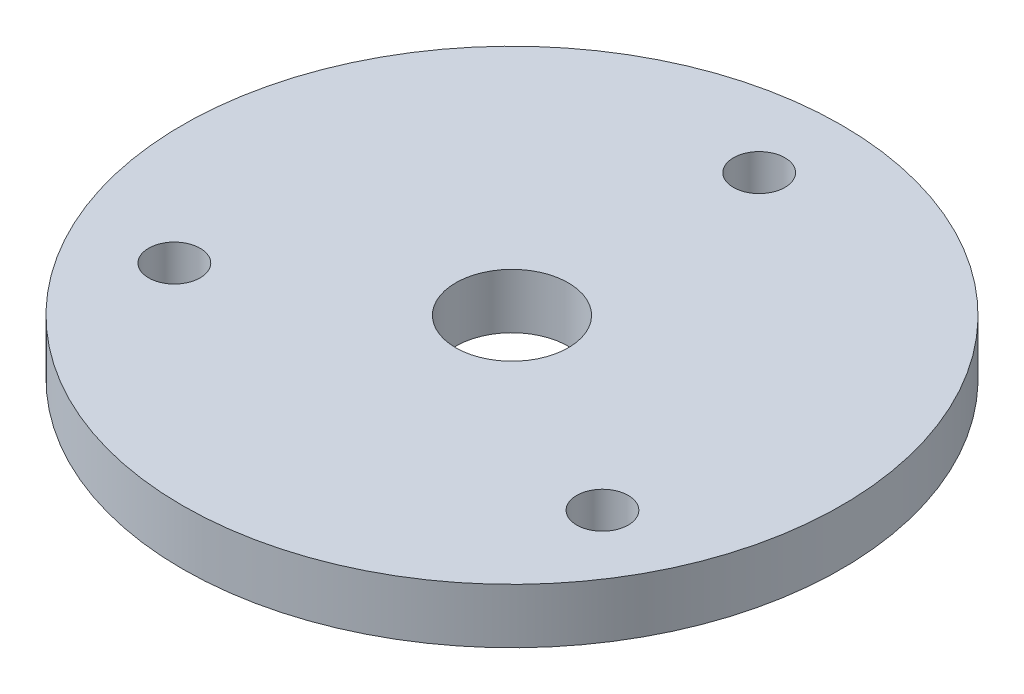
ISO-10303-21;
HEADER;
FILE_DESCRIPTION(('STEP AP214'),'2;1');
FILE_NAME('part.step','',(''),(''),'','','');
FILE_SCHEMA(('AUTOMOTIVE_DESIGN { 1 0 10303 214 1 1 1 1 }'));
ENDSEC;
DATA;
#1=APPLICATION_CONTEXT('core data for automotive mechanical design processes');
#2=APPLICATION_PROTOCOL_DEFINITION('international standard','automotive_design',2000,#1);
#3=PRODUCT_CONTEXT('',#1,'mechanical');
#4=PRODUCT('Part','Part','',(#3));
#5=PRODUCT_RELATED_PRODUCT_CATEGORY('part','',(#4));
#6=PRODUCT_DEFINITION_FORMATION('','',#4);
#7=PRODUCT_DEFINITION_CONTEXT('part definition',#1,'design');
#8=PRODUCT_DEFINITION('design','',#6,#7);
#9=PRODUCT_DEFINITION_SHAPE('','',#8);
#10=(LENGTH_UNIT() NAMED_UNIT(*) SI_UNIT(.MILLI.,.METRE.));
#11=(NAMED_UNIT(*) PLANE_ANGLE_UNIT() SI_UNIT($,.RADIAN.));
#12=(NAMED_UNIT(*) SI_UNIT($,.STERADIAN.) SOLID_ANGLE_UNIT());
#13=UNCERTAINTY_MEASURE_WITH_UNIT(LENGTH_MEASURE(1.E-05),#10,'distance_accuracy_value','');
#14=(GEOMETRIC_REPRESENTATION_CONTEXT(3) GLOBAL_UNCERTAINTY_ASSIGNED_CONTEXT((#13)) GLOBAL_UNIT_ASSIGNED_CONTEXT((#10,
#11,#12)) REPRESENTATION_CONTEXT('',''));
#15=CARTESIAN_POINT('',(0.,0.,0.));
#16=DIRECTION('',(0.,0.,1.));
#17=DIRECTION('',(1.,0.,0.));
#18=AXIS2_PLACEMENT_3D('',#15,#16,#17);
#19=CARTESIAN_POINT('',(0.,6.35,0.));
#20=DIRECTION('',(0.,-1.,0.));
#21=DIRECTION('',(0.,0.,-1.));
#22=AXIS2_PLACEMENT_3D('',#19,#20,#21);
#23=CYLINDRICAL_SURFACE('',#22,76.2);
#24=CARTESIAN_POINT('',(0.,6.35,0.));
#25=DIRECTION('',(0.,1.,0.));
#26=DIRECTION('',(0.,0.,1.));
#27=AXIS2_PLACEMENT_3D('',#24,#25,#26);
#28=CIRCLE('',#27,76.2);
#29=CARTESIAN_POINT('',(0.,6.35,76.2));
#30=VERTEX_POINT('',#29);
#31=EDGE_CURVE('E11',#30,#30,#28,.T.);
#32=ORIENTED_EDGE('',*,*,#31,.F.);
#33=EDGE_LOOP('',(#32));
#34=FACE_BOUND('',#33,.T.);
#35=CARTESIAN_POINT('',(0.,-6.35,0.));
#36=DIRECTION('',(0.,1.,0.));
#37=DIRECTION('',(0.,0.,1.));
#38=AXIS2_PLACEMENT_3D('',#35,#36,#37);
#39=CIRCLE('',#38,76.2);
#40=CARTESIAN_POINT('',(0.,-6.35,76.2));
#41=VERTEX_POINT('',#40);
#42=EDGE_CURVE('E48',#41,#41,#39,.T.);
#43=ORIENTED_EDGE('',*,*,#42,.T.);
#44=EDGE_LOOP('',(#43));
#45=FACE_BOUND('',#44,.T.);
#46=ADVANCED_FACE('F41',(#34,#45),#23,.T.);
#47=CARTESIAN_POINT('',(0.,6.35,0.));
#48=DIRECTION('',(0.,1.,0.));
#49=DIRECTION('',(0.,0.,1.));
#50=AXIS2_PLACEMENT_3D('',#47,#48,#49);
#51=PLANE('',#50);
#52=CARTESIAN_POINT('',(-49.4933518262807,6.35,28.575));
#53=DIRECTION('',(0.,1.,0.));
#54=DIRECTION('',(0.,0.,1.));
#55=AXIS2_PLACEMENT_3D('',#52,#53,#54);
#56=CIRCLE('',#55,5.953125);
#57=CARTESIAN_POINT('',(-49.4933518262807,6.35,34.528125));
#58=VERTEX_POINT('',#57);
#59=EDGE_CURVE('E65',#58,#58,#56,.T.);
#60=ORIENTED_EDGE('',*,*,#59,.F.);
#61=EDGE_LOOP('',(#60));
#62=FACE_BOUND('',#61,.T.);
#63=CARTESIAN_POINT('',(49.4933518262807,6.35,28.575));
#64=DIRECTION('',(0.,1.,0.));
#65=DIRECTION('',(0.,0.,1.));
#66=AXIS2_PLACEMENT_3D('',#63,#64,#65);
#67=CIRCLE('',#66,5.95312500000001);
#68=CARTESIAN_POINT('',(49.4933518262807,6.35,34.528125));
#69=VERTEX_POINT('',#68);
#70=EDGE_CURVE('E71',#69,#69,#67,.T.);
#71=ORIENTED_EDGE('',*,*,#70,.F.);
#72=EDGE_LOOP('',(#71));
#73=FACE_BOUND('',#72,.T.);
#74=CARTESIAN_POINT('',(0.,6.35,-57.15));
#75=DIRECTION('',(0.,1.,0.));
#76=DIRECTION('',(0.,0.,1.));
#77=AXIS2_PLACEMENT_3D('',#74,#75,#76);
#78=CIRCLE('',#77,5.953125);
#79=CARTESIAN_POINT('',(0.,6.35,-51.196875));
#80=VERTEX_POINT('',#79);
#81=EDGE_CURVE('E60',#80,#80,#78,.T.);
#82=ORIENTED_EDGE('',*,*,#81,.F.);
#83=EDGE_LOOP('',(#82));
#84=FACE_BOUND('',#83,.T.);
#85=CARTESIAN_POINT('',(0.,6.35,0.));
#86=DIRECTION('',(0.,1.,0.));
#87=DIRECTION('',(0.,0.,1.));
#88=AXIS2_PLACEMENT_3D('',#85,#86,#87);
#89=CIRCLE('',#88,13.0175);
#90=CARTESIAN_POINT('',(0.,6.35,13.0175));
#91=VERTEX_POINT('',#90);
#92=EDGE_CURVE('E56',#91,#91,#89,.T.);
#93=ORIENTED_EDGE('',*,*,#92,.F.);
#94=EDGE_LOOP('',(#93));
#95=FACE_BOUND('',#94,.T.);
#96=ORIENTED_EDGE('',*,*,#31,.T.);
#97=EDGE_LOOP('',(#96));
#98=FACE_BOUND('',#97,.T.);
#99=ADVANCED_FACE('F82',(#62,#73,#84,#95,#98),#51,.T.);
#100=CARTESIAN_POINT('',(0.,-6.35,0.));
#101=DIRECTION('',(0.,1.,0.));
#102=DIRECTION('',(0.,0.,1.));
#103=AXIS2_PLACEMENT_3D('',#100,#101,#102);
#104=PLANE('',#103);
#105=CARTESIAN_POINT('',(-49.4933518262807,-6.35,28.575));
#106=DIRECTION('',(0.,1.,0.));
#107=DIRECTION('',(0.,0.,1.));
#108=AXIS2_PLACEMENT_3D('',#105,#106,#107);
#109=CIRCLE('',#108,5.953125);
#110=CARTESIAN_POINT('',(-49.4933518262807,-6.35,34.528125));
#111=VERTEX_POINT('',#110);
#112=EDGE_CURVE('E62',#111,#111,#109,.T.);
#113=ORIENTED_EDGE('',*,*,#112,.T.);
#114=EDGE_LOOP('',(#113));
#115=FACE_BOUND('',#114,.T.);
#116=CARTESIAN_POINT('',(49.4933518262807,-6.35,28.575));
#117=DIRECTION('',(0.,1.,0.));
#118=DIRECTION('',(0.,0.,1.));
#119=AXIS2_PLACEMENT_3D('',#116,#117,#118);
#120=CIRCLE('',#119,5.95312500000001);
#121=CARTESIAN_POINT('',(49.4933518262807,-6.35,34.528125));
#122=VERTEX_POINT('',#121);
#123=EDGE_CURVE('E68',#122,#122,#120,.T.);
#124=ORIENTED_EDGE('',*,*,#123,.T.);
#125=EDGE_LOOP('',(#124));
#126=FACE_BOUND('',#125,.T.);
#127=CARTESIAN_POINT('',(0.,-6.35,-57.15));
#128=DIRECTION('',(0.,1.,0.));
#129=DIRECTION('',(0.,0.,1.));
#130=AXIS2_PLACEMENT_3D('',#127,#128,#129);
#131=CIRCLE('',#130,5.953125);
#132=CARTESIAN_POINT('',(0.,-6.35,-51.196875));
#133=VERTEX_POINT('',#132);
#134=EDGE_CURVE('E74',#133,#133,#131,.T.);
#135=ORIENTED_EDGE('',*,*,#134,.T.);
#136=EDGE_LOOP('',(#135));
#137=FACE_BOUND('',#136,.T.);
#138=CARTESIAN_POINT('',(0.,-6.35,0.));
#139=DIRECTION('',(0.,1.,0.));
#140=DIRECTION('',(0.,0.,1.));
#141=AXIS2_PLACEMENT_3D('',#138,#139,#140);
#142=CIRCLE('',#141,13.0175);
#143=CARTESIAN_POINT('',(0.,-6.35,13.0175));
#144=VERTEX_POINT('',#143);
#145=EDGE_CURVE('E52',#144,#144,#142,.T.);
#146=ORIENTED_EDGE('',*,*,#145,.T.);
#147=EDGE_LOOP('',(#146));
#148=FACE_BOUND('',#147,.T.);
#149=ORIENTED_EDGE('',*,*,#42,.F.);
#150=EDGE_LOOP('',(#149));
#151=FACE_BOUND('',#150,.T.);
#152=ADVANCED_FACE('F85',(#115,#126,#137,#148,#151),#104,.F.);
#153=CARTESIAN_POINT('',(0.,-6.35,0.));
#154=DIRECTION('',(0.,1.,0.));
#155=DIRECTION('',(0.,0.,1.));
#156=AXIS2_PLACEMENT_3D('',#153,#154,#155);
#157=CYLINDRICAL_SURFACE('',#156,13.0175);
#158=ORIENTED_EDGE('',*,*,#145,.F.);
#159=EDGE_LOOP('',(#158));
#160=FACE_BOUND('',#159,.T.);
#161=ORIENTED_EDGE('',*,*,#92,.T.);
#162=EDGE_LOOP('',(#161));
#163=FACE_BOUND('',#162,.T.);
#164=ADVANCED_FACE('F89',(#160,#163),#157,.F.);
#165=CARTESIAN_POINT('',(0.,-6.35,-57.15));
#166=DIRECTION('',(0.,1.,0.));
#167=DIRECTION('',(0.,0.,1.));
#168=AXIS2_PLACEMENT_3D('',#165,#166,#167);
#169=CYLINDRICAL_SURFACE('',#168,5.953125);
#170=ORIENTED_EDGE('',*,*,#134,.F.);
#171=EDGE_LOOP('',(#170));
#172=FACE_BOUND('',#171,.T.);
#173=ORIENTED_EDGE('',*,*,#81,.T.);
#174=EDGE_LOOP('',(#173));
#175=FACE_BOUND('',#174,.T.);
#176=ADVANCED_FACE('F80',(#172,#175),#169,.F.);
#177=CARTESIAN_POINT('',(49.4933518262807,-6.35,28.575));
#178=DIRECTION('',(0.,1.,0.));
#179=DIRECTION('',(0.,0.,1.));
#180=AXIS2_PLACEMENT_3D('',#177,#178,#179);
#181=CYLINDRICAL_SURFACE('',#180,5.95312500000001);
#182=ORIENTED_EDGE('',*,*,#123,.F.);
#183=EDGE_LOOP('',(#182));
#184=FACE_BOUND('',#183,.T.);
#185=ORIENTED_EDGE('',*,*,#70,.T.);
#186=EDGE_LOOP('',(#185));
#187=FACE_BOUND('',#186,.T.);
#188=ADVANCED_FACE('F97',(#184,#187),#181,.F.);
#189=CARTESIAN_POINT('',(-49.4933518262807,-6.35,28.575));
#190=DIRECTION('',(0.,1.,0.));
#191=DIRECTION('',(0.,0.,1.));
#192=AXIS2_PLACEMENT_3D('',#189,#190,#191);
#193=CYLINDRICAL_SURFACE('',#192,5.953125);
#194=ORIENTED_EDGE('',*,*,#112,.F.);
#195=EDGE_LOOP('',(#194));
#196=FACE_BOUND('',#195,.T.);
#197=ORIENTED_EDGE('',*,*,#59,.T.);
#198=EDGE_LOOP('',(#197));
#199=FACE_BOUND('',#198,.T.);
#200=ADVANCED_FACE('F137',(#196,#199),#193,.F.);
#201=CLOSED_SHELL('',(#46,#99,#152,#164,#176,#188,#200));
#202=MANIFOLD_SOLID_BREP('B2',#201);
#203=ADVANCED_BREP_SHAPE_REPRESENTATION('',(#18,#202),#14);
#204=SHAPE_DEFINITION_REPRESENTATION(#9,#203);
ENDSEC;
END-ISO-10303-21;
